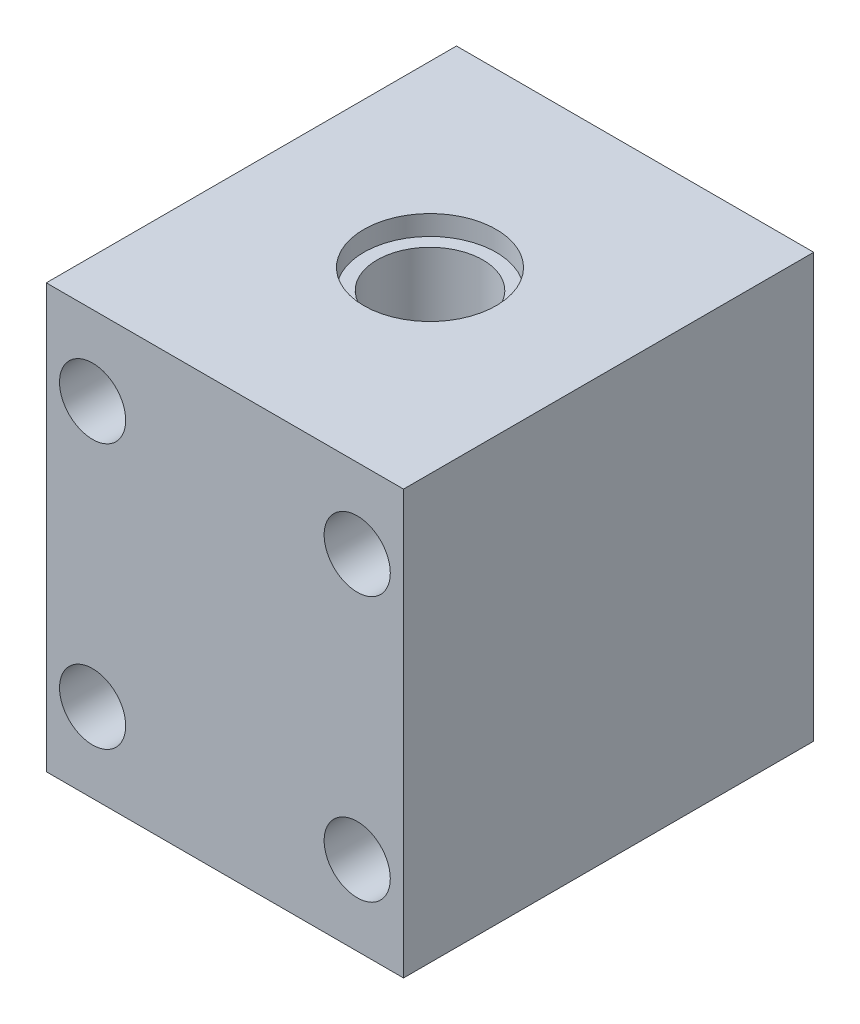
ISO-10303-21;
HEADER;
FILE_DESCRIPTION(('STEP AP214'),'2;1');
FILE_NAME('part.step','',(''),(''),'','','');
FILE_SCHEMA(('AUTOMOTIVE_DESIGN { 1 0 10303 214 1 1 1 1 }'));
ENDSEC;
DATA;
#1=APPLICATION_CONTEXT('core data for automotive mechanical design processes');
#2=APPLICATION_PROTOCOL_DEFINITION('international standard','automotive_design',2000,#1);
#3=PRODUCT_CONTEXT('',#1,'mechanical');
#4=PRODUCT('Part','Part','',(#3));
#5=PRODUCT_RELATED_PRODUCT_CATEGORY('part','',(#4));
#6=PRODUCT_DEFINITION_FORMATION('','',#4);
#7=PRODUCT_DEFINITION_CONTEXT('part definition',#1,'design');
#8=PRODUCT_DEFINITION('design','',#6,#7);
#9=PRODUCT_DEFINITION_SHAPE('','',#8);
#10=(LENGTH_UNIT() NAMED_UNIT(*) SI_UNIT(.MILLI.,.METRE.));
#11=(NAMED_UNIT(*) PLANE_ANGLE_UNIT() SI_UNIT($,.RADIAN.));
#12=(NAMED_UNIT(*) SI_UNIT($,.STERADIAN.) SOLID_ANGLE_UNIT());
#13=UNCERTAINTY_MEASURE_WITH_UNIT(LENGTH_MEASURE(1.E-05),#10,'distance_accuracy_value','');
#14=(GEOMETRIC_REPRESENTATION_CONTEXT(3) GLOBAL_UNCERTAINTY_ASSIGNED_CONTEXT((#13)) GLOBAL_UNIT_ASSIGNED_CONTEXT((#10,
#11,#12)) REPRESENTATION_CONTEXT('',''));
#15=CARTESIAN_POINT('',(0.,0.,0.));
#16=DIRECTION('',(0.,0.,1.));
#17=DIRECTION('',(1.,0.,0.));
#18=AXIS2_PLACEMENT_3D('',#15,#16,#17);
#19=CARTESIAN_POINT('',(10.,10.,31.));
#20=DIRECTION('',(0.,0.,-1.));
#21=DIRECTION('',(-1.,0.,0.));
#22=AXIS2_PLACEMENT_3D('',#19,#20,#21);
#23=CYLINDRICAL_SURFACE('',#22,1.5);
#24=CARTESIAN_POINT('',(10.,10.,0.));
#25=DIRECTION('',(0.,0.,-1.));
#26=DIRECTION('',(-1.,0.,0.));
#27=AXIS2_PLACEMENT_3D('',#24,#25,#26);
#28=CIRCLE('',#27,1.5);
#29=CARTESIAN_POINT('',(8.5,10.,0.));
#30=VERTEX_POINT('',#29);
#31=EDGE_CURVE('E103',#30,#30,#28,.T.);
#32=ORIENTED_EDGE('',*,*,#31,.T.);
#33=EDGE_LOOP('',(#32));
#34=FACE_BOUND('',#33,.T.);
#35=CARTESIAN_POINT('',(10.,10.,16.));
#36=DIRECTION('',(0.,0.,1.));
#37=DIRECTION('',(1.,0.,0.));
#38=AXIS2_PLACEMENT_3D('',#35,#36,#37);
#39=CIRCLE('',#38,1.5);
#40=CARTESIAN_POINT('',(11.5,10.,16.));
#41=VERTEX_POINT('',#40);
#42=EDGE_CURVE('E37',#41,#41,#39,.F.);
#43=ORIENTED_EDGE('',*,*,#42,.F.);
#44=EDGE_LOOP('',(#43));
#45=FACE_BOUND('',#44,.T.);
#46=ADVANCED_FACE('F33',(#34,#45),#23,.F.);
#47=CARTESIAN_POINT('',(-10.,10.,31.));
#48=DIRECTION('',(0.,0.,-1.));
#49=DIRECTION('',(-1.,0.,0.));
#50=AXIS2_PLACEMENT_3D('',#47,#48,#49);
#51=CYLINDRICAL_SURFACE('',#50,1.5);
#52=CARTESIAN_POINT('',(-10.,10.,0.));
#53=DIRECTION('',(0.,0.,-1.));
#54=DIRECTION('',(-1.,0.,0.));
#55=AXIS2_PLACEMENT_3D('',#52,#53,#54);
#56=CIRCLE('',#55,1.5);
#57=CARTESIAN_POINT('',(-11.5,10.,0.));
#58=VERTEX_POINT('',#57);
#59=EDGE_CURVE('E145',#58,#58,#56,.T.);
#60=ORIENTED_EDGE('',*,*,#59,.T.);
#61=EDGE_LOOP('',(#60));
#62=FACE_BOUND('',#61,.T.);
#63=CARTESIAN_POINT('',(-10.,10.,16.));
#64=DIRECTION('',(0.,0.,1.));
#65=DIRECTION('',(1.,0.,0.));
#66=AXIS2_PLACEMENT_3D('',#63,#64,#65);
#67=CIRCLE('',#66,1.5);
#68=CARTESIAN_POINT('',(-8.5,10.,16.));
#69=VERTEX_POINT('',#68);
#70=EDGE_CURVE('E125',#69,#69,#67,.F.);
#71=ORIENTED_EDGE('',*,*,#70,.F.);
#72=EDGE_LOOP('',(#71));
#73=FACE_BOUND('',#72,.T.);
#74=ADVANCED_FACE('F178',(#62,#73),#51,.F.);
#75=CARTESIAN_POINT('',(-10.,-10.,31.));
#76=DIRECTION('',(0.,0.,-1.));
#77=DIRECTION('',(-1.,0.,0.));
#78=AXIS2_PLACEMENT_3D('',#75,#76,#77);
#79=CYLINDRICAL_SURFACE('',#78,1.5);
#80=CARTESIAN_POINT('',(-10.,-10.,0.));
#81=DIRECTION('',(0.,0.,-1.));
#82=DIRECTION('',(-1.,0.,0.));
#83=AXIS2_PLACEMENT_3D('',#80,#81,#82);
#84=CIRCLE('',#83,1.5);
#85=CARTESIAN_POINT('',(-11.5,-10.,0.));
#86=VERTEX_POINT('',#85);
#87=EDGE_CURVE('E148',#86,#86,#84,.T.);
#88=ORIENTED_EDGE('',*,*,#87,.T.);
#89=EDGE_LOOP('',(#88));
#90=FACE_BOUND('',#89,.T.);
#91=CARTESIAN_POINT('',(-10.,-10.,16.));
#92=DIRECTION('',(0.,0.,1.));
#93=DIRECTION('',(1.,0.,0.));
#94=AXIS2_PLACEMENT_3D('',#91,#92,#93);
#95=CIRCLE('',#94,1.5);
#96=CARTESIAN_POINT('',(-8.5,-10.,16.));
#97=VERTEX_POINT('',#96);
#98=EDGE_CURVE('E122',#97,#97,#95,.F.);
#99=ORIENTED_EDGE('',*,*,#98,.F.);
#100=EDGE_LOOP('',(#99));
#101=FACE_BOUND('',#100,.T.);
#102=ADVANCED_FACE('F183',(#90,#101),#79,.F.);
#103=CARTESIAN_POINT('',(10.,-10.,31.));
#104=DIRECTION('',(0.,0.,-1.));
#105=DIRECTION('',(-1.,0.,0.));
#106=AXIS2_PLACEMENT_3D('',#103,#104,#105);
#107=CYLINDRICAL_SURFACE('',#106,1.5);
#108=CARTESIAN_POINT('',(10.,-10.,0.));
#109=DIRECTION('',(0.,0.,-1.));
#110=DIRECTION('',(-1.,0.,0.));
#111=AXIS2_PLACEMENT_3D('',#108,#109,#110);
#112=CIRCLE('',#111,1.5);
#113=CARTESIAN_POINT('',(8.5,-10.,0.));
#114=VERTEX_POINT('',#113);
#115=EDGE_CURVE('E112',#114,#114,#112,.T.);
#116=ORIENTED_EDGE('',*,*,#115,.T.);
#117=EDGE_LOOP('',(#116));
#118=FACE_BOUND('',#117,.T.);
#119=CARTESIAN_POINT('',(10.,-10.,16.));
#120=DIRECTION('',(0.,0.,1.));
#121=DIRECTION('',(1.,0.,0.));
#122=AXIS2_PLACEMENT_3D('',#119,#120,#121);
#123=CIRCLE('',#122,1.5);
#124=CARTESIAN_POINT('',(11.5,-10.,16.));
#125=VERTEX_POINT('',#124);
#126=EDGE_CURVE('E119',#125,#125,#123,.F.);
#127=ORIENTED_EDGE('',*,*,#126,.F.);
#128=EDGE_LOOP('',(#127));
#129=FACE_BOUND('',#128,.T.);
#130=ADVANCED_FACE('F187',(#118,#129),#107,.F.);
#131=CARTESIAN_POINT('',(0.,-16.,15.5));
#132=DIRECTION('',(0.,1.,0.));
#133=DIRECTION('',(0.,0.,1.));
#134=AXIS2_PLACEMENT_3D('',#131,#132,#133);
#135=CYLINDRICAL_SURFACE('',#134,4.);
#136=CARTESIAN_POINT('',(0.,14.5,15.5));
#137=DIRECTION('',(0.,1.,0.));
#138=DIRECTION('',(0.,0.,1.));
#139=AXIS2_PLACEMENT_3D('',#136,#137,#138);
#140=CIRCLE('',#139,4.);
#141=CARTESIAN_POINT('',(0.,14.5,19.5));
#142=VERTEX_POINT('',#141);
#143=EDGE_CURVE('E109',#142,#142,#140,.F.);
#144=ORIENTED_EDGE('',*,*,#143,.F.);
#145=EDGE_LOOP('',(#144));
#146=FACE_BOUND('',#145,.T.);
#147=CARTESIAN_POINT('',(0.,-14.5,15.5));
#148=DIRECTION('',(0.,-1.,0.));
#149=DIRECTION('',(0.,0.,-1.));
#150=AXIS2_PLACEMENT_3D('',#147,#148,#149);
#151=CIRCLE('',#150,4.);
#152=CARTESIAN_POINT('',(0.,-14.5,11.5));
#153=VERTEX_POINT('',#152);
#154=EDGE_CURVE('E114',#153,#153,#151,.F.);
#155=ORIENTED_EDGE('',*,*,#154,.F.);
#156=EDGE_LOOP('',(#155));
#157=FACE_BOUND('',#156,.T.);
#158=ADVANCED_FACE('F190',(#146,#157),#135,.F.);
#159=CARTESIAN_POINT('',(13.5,16.,31.));
#160=DIRECTION('',(-1.,0.,0.));
#161=DIRECTION('',(0.,-1.,0.));
#162=AXIS2_PLACEMENT_3D('',#159,#160,#161);
#163=PLANE('',#162);
#164=DIRECTION('',(0.,1.,0.));
#165=VECTOR('',#164,1.);
#166=CARTESIAN_POINT('',(13.5,16.,0.));
#167=LINE('',#166,#165);
#168=CARTESIAN_POINT('',(13.5,-16.,0.));
#169=VERTEX_POINT('',#168);
#170=CARTESIAN_POINT('',(13.5,16.,0.));
#171=VERTEX_POINT('',#170);
#172=EDGE_CURVE('E100',#169,#171,#167,.T.);
#173=ORIENTED_EDGE('',*,*,#172,.T.);
#174=DIRECTION('',(0.,0.,-1.));
#175=VECTOR('',#174,1.);
#176=CARTESIAN_POINT('',(13.5,16.,31.));
#177=LINE('',#176,#175);
#178=CARTESIAN_POINT('',(13.5,16.,31.));
#179=VERTEX_POINT('',#178);
#180=EDGE_CURVE('E11',#179,#171,#177,.T.);
#181=ORIENTED_EDGE('',*,*,#180,.F.);
#182=DIRECTION('',(0.,1.,0.));
#183=VECTOR('',#182,1.);
#184=CARTESIAN_POINT('',(13.5,16.,31.));
#185=LINE('',#184,#183);
#186=CARTESIAN_POINT('',(13.5,-16.,31.));
#187=VERTEX_POINT('',#186);
#188=EDGE_CURVE('E87',#187,#179,#185,.T.);
#189=ORIENTED_EDGE('',*,*,#188,.F.);
#190=DIRECTION('',(0.,0.,-1.));
#191=VECTOR('',#190,1.);
#192=CARTESIAN_POINT('',(13.5,-16.,31.));
#193=LINE('',#192,#191);
#194=EDGE_CURVE('E96',#187,#169,#193,.T.);
#195=ORIENTED_EDGE('',*,*,#194,.T.);
#196=EDGE_LOOP('',(#173,#181,#189,#195));
#197=FACE_BOUND('',#196,.T.);
#198=ADVANCED_FACE('F35',(#197),#163,.F.);
#199=CARTESIAN_POINT('',(-13.5,16.,31.));
#200=DIRECTION('',(0.,-1.,0.));
#201=DIRECTION('',(0.,0.,-1.));
#202=AXIS2_PLACEMENT_3D('',#199,#200,#201);
#203=PLANE('',#202);
#204=CARTESIAN_POINT('',(0.,16.,15.5));
#205=DIRECTION('',(0.,1.,0.));
#206=DIRECTION('',(0.,0.,1.));
#207=AXIS2_PLACEMENT_3D('',#204,#205,#206);
#208=CIRCLE('',#207,5.);
#209=CARTESIAN_POINT('',(0.,16.,20.5));
#210=VERTEX_POINT('',#209);
#211=EDGE_CURVE('E117',#210,#210,#208,.T.);
#212=ORIENTED_EDGE('',*,*,#211,.F.);
#213=EDGE_LOOP('',(#212));
#214=FACE_BOUND('',#213,.T.);
#215=DIRECTION('',(-1.,0.,0.));
#216=VECTOR('',#215,1.);
#217=CARTESIAN_POINT('',(-13.5,16.,0.));
#218=LINE('',#217,#216);
#219=CARTESIAN_POINT('',(-13.5,16.,0.));
#220=VERTEX_POINT('',#219);
#221=EDGE_CURVE('E91',#171,#220,#218,.T.);
#222=ORIENTED_EDGE('',*,*,#221,.T.);
#223=DIRECTION('',(0.,0.,-1.));
#224=VECTOR('',#223,1.);
#225=CARTESIAN_POINT('',(-13.5,16.,31.));
#226=LINE('',#225,#224);
#227=CARTESIAN_POINT('',(-13.5,16.,31.));
#228=VERTEX_POINT('',#227);
#229=EDGE_CURVE('E43',#228,#220,#226,.T.);
#230=ORIENTED_EDGE('',*,*,#229,.F.);
#231=DIRECTION('',(-1.,0.,0.));
#232=VECTOR('',#231,1.);
#233=CARTESIAN_POINT('',(-13.5,16.,31.));
#234=LINE('',#233,#232);
#235=EDGE_CURVE('E82',#179,#228,#234,.T.);
#236=ORIENTED_EDGE('',*,*,#235,.F.);
#237=ORIENTED_EDGE('',*,*,#180,.T.);
#238=EDGE_LOOP('',(#222,#230,#236,#237));
#239=FACE_BOUND('',#238,.T.);
#240=ADVANCED_FACE('F90',(#214,#239),#203,.F.);
#241=CARTESIAN_POINT('',(-13.5,16.,31.));
#242=DIRECTION('',(1.,0.,0.));
#243=DIRECTION('',(0.,1.,0.));
#244=AXIS2_PLACEMENT_3D('',#241,#242,#243);
#245=PLANE('',#244);
#246=DIRECTION('',(0.,-1.,0.));
#247=VECTOR('',#246,1.);
#248=CARTESIAN_POINT('',(-13.5,16.,0.));
#249=LINE('',#248,#247);
#250=CARTESIAN_POINT('',(-13.5,-16.,0.));
#251=VERTEX_POINT('',#250);
#252=EDGE_CURVE('E69',#220,#251,#249,.T.);
#253=ORIENTED_EDGE('',*,*,#252,.T.);
#254=DIRECTION('',(0.,0.,-1.));
#255=VECTOR('',#254,1.);
#256=CARTESIAN_POINT('',(-13.5,-16.,31.));
#257=LINE('',#256,#255);
#258=CARTESIAN_POINT('',(-13.5,-16.,31.));
#259=VERTEX_POINT('',#258);
#260=EDGE_CURVE('E92',#259,#251,#257,.T.);
#261=ORIENTED_EDGE('',*,*,#260,.F.);
#262=DIRECTION('',(0.,-1.,0.));
#263=VECTOR('',#262,1.);
#264=CARTESIAN_POINT('',(-13.5,16.,31.));
#265=LINE('',#264,#263);
#266=EDGE_CURVE('E85',#228,#259,#265,.T.);
#267=ORIENTED_EDGE('',*,*,#266,.F.);
#268=ORIENTED_EDGE('',*,*,#229,.T.);
#269=EDGE_LOOP('',(#253,#261,#267,#268));
#270=FACE_BOUND('',#269,.T.);
#271=ADVANCED_FACE('F94',(#270),#245,.F.);
#272=CARTESIAN_POINT('',(-13.5,-16.,31.));
#273=DIRECTION('',(0.,1.,0.));
#274=DIRECTION('',(0.,0.,1.));
#275=AXIS2_PLACEMENT_3D('',#272,#273,#274);
#276=PLANE('',#275);
#277=CARTESIAN_POINT('',(0.,-16.,15.5));
#278=DIRECTION('',(0.,-1.,0.));
#279=DIRECTION('',(0.,0.,-1.));
#280=AXIS2_PLACEMENT_3D('',#277,#278,#279);
#281=CIRCLE('',#280,5.);
#282=CARTESIAN_POINT('',(0.,-16.,10.5));
#283=VERTEX_POINT('',#282);
#284=EDGE_CURVE('E130',#283,#283,#281,.T.);
#285=ORIENTED_EDGE('',*,*,#284,.F.);
#286=EDGE_LOOP('',(#285));
#287=FACE_BOUND('',#286,.T.);
#288=DIRECTION('',(1.,0.,0.));
#289=VECTOR('',#288,1.);
#290=CARTESIAN_POINT('',(-13.5,-16.,0.));
#291=LINE('',#290,#289);
#292=EDGE_CURVE('E75',#251,#169,#291,.T.);
#293=ORIENTED_EDGE('',*,*,#292,.T.);
#294=ORIENTED_EDGE('',*,*,#194,.F.);
#295=DIRECTION('',(1.,0.,0.));
#296=VECTOR('',#295,1.);
#297=CARTESIAN_POINT('',(-13.5,-16.,31.));
#298=LINE('',#297,#296);
#299=EDGE_CURVE('E52',#259,#187,#298,.T.);
#300=ORIENTED_EDGE('',*,*,#299,.F.);
#301=ORIENTED_EDGE('',*,*,#260,.T.);
#302=EDGE_LOOP('',(#293,#294,#300,#301));
#303=FACE_BOUND('',#302,.T.);
#304=ADVANCED_FACE('F166',(#287,#303),#276,.F.);
#305=CARTESIAN_POINT('',(0.,0.,31.));
#306=DIRECTION('',(0.,0.,1.));
#307=DIRECTION('',(1.,0.,0.));
#308=AXIS2_PLACEMENT_3D('',#305,#306,#307);
#309=PLANE('',#308);
#310=CARTESIAN_POINT('',(-10.,-10.,31.));
#311=DIRECTION('',(0.,0.,1.));
#312=DIRECTION('',(1.,0.,0.));
#313=AXIS2_PLACEMENT_3D('',#310,#311,#312);
#314=CIRCLE('',#313,2.5);
#315=CARTESIAN_POINT('',(-7.5,-10.,31.));
#316=VERTEX_POINT('',#315);
#317=EDGE_CURVE('E265',#316,#316,#314,.T.);
#318=ORIENTED_EDGE('',*,*,#317,.F.);
#319=EDGE_LOOP('',(#318));
#320=FACE_BOUND('',#319,.T.);
#321=CARTESIAN_POINT('',(10.,-10.,31.));
#322=DIRECTION('',(0.,0.,1.));
#323=DIRECTION('',(1.,0.,0.));
#324=AXIS2_PLACEMENT_3D('',#321,#322,#323);
#325=CIRCLE('',#324,2.5);
#326=CARTESIAN_POINT('',(12.5,-10.,31.));
#327=VERTEX_POINT('',#326);
#328=EDGE_CURVE('E259',#327,#327,#325,.T.);
#329=ORIENTED_EDGE('',*,*,#328,.F.);
#330=EDGE_LOOP('',(#329));
#331=FACE_BOUND('',#330,.T.);
#332=CARTESIAN_POINT('',(10.,10.,31.));
#333=DIRECTION('',(0.,0.,1.));
#334=DIRECTION('',(1.,0.,0.));
#335=AXIS2_PLACEMENT_3D('',#332,#333,#334);
#336=CIRCLE('',#335,2.5);
#337=CARTESIAN_POINT('',(12.5,10.,31.));
#338=VERTEX_POINT('',#337);
#339=EDGE_CURVE('E250',#338,#338,#336,.T.);
#340=ORIENTED_EDGE('',*,*,#339,.F.);
#341=EDGE_LOOP('',(#340));
#342=FACE_BOUND('',#341,.T.);
#343=CARTESIAN_POINT('',(-10.,10.,31.));
#344=DIRECTION('',(0.,0.,1.));
#345=DIRECTION('',(1.,0.,0.));
#346=AXIS2_PLACEMENT_3D('',#343,#344,#345);
#347=CIRCLE('',#346,2.5);
#348=CARTESIAN_POINT('',(-7.5,10.,31.));
#349=VERTEX_POINT('',#348);
#350=EDGE_CURVE('E249',#349,#349,#347,.T.);
#351=ORIENTED_EDGE('',*,*,#350,.F.);
#352=EDGE_LOOP('',(#351));
#353=FACE_BOUND('',#352,.T.);
#354=ORIENTED_EDGE('',*,*,#188,.T.);
#355=ORIENTED_EDGE('',*,*,#235,.T.);
#356=ORIENTED_EDGE('',*,*,#266,.T.);
#357=ORIENTED_EDGE('',*,*,#299,.T.);
#358=EDGE_LOOP('',(#354,#355,#356,#357));
#359=FACE_BOUND('',#358,.T.);
#360=ADVANCED_FACE('F83',(#320,#331,#342,#353,#359),#309,.T.);
#361=CARTESIAN_POINT('',(0.,0.,0.));
#362=DIRECTION('',(0.,0.,1.));
#363=DIRECTION('',(1.,0.,0.));
#364=AXIS2_PLACEMENT_3D('',#361,#362,#363);
#365=PLANE('',#364);
#366=ORIENTED_EDGE('',*,*,#115,.F.);
#367=EDGE_LOOP('',(#366));
#368=FACE_BOUND('',#367,.T.);
#369=ORIENTED_EDGE('',*,*,#87,.F.);
#370=EDGE_LOOP('',(#369));
#371=FACE_BOUND('',#370,.T.);
#372=ORIENTED_EDGE('',*,*,#59,.F.);
#373=EDGE_LOOP('',(#372));
#374=FACE_BOUND('',#373,.T.);
#375=ORIENTED_EDGE('',*,*,#31,.F.);
#376=EDGE_LOOP('',(#375));
#377=FACE_BOUND('',#376,.T.);
#378=ORIENTED_EDGE('',*,*,#172,.F.);
#379=ORIENTED_EDGE('',*,*,#292,.F.);
#380=ORIENTED_EDGE('',*,*,#252,.F.);
#381=ORIENTED_EDGE('',*,*,#221,.F.);
#382=EDGE_LOOP('',(#378,#379,#380,#381));
#383=FACE_BOUND('',#382,.T.);
#384=ADVANCED_FACE('F158',(#368,#371,#374,#377,#383),#365,.F.);
#385=CARTESIAN_POINT('',(0.,14.5,15.5));
#386=DIRECTION('',(0.,1.,0.));
#387=DIRECTION('',(0.,0.,1.));
#388=AXIS2_PLACEMENT_3D('',#385,#386,#387);
#389=PLANE('',#388);
#390=CARTESIAN_POINT('',(0.,14.5,15.5));
#391=DIRECTION('',(0.,1.,0.));
#392=DIRECTION('',(0.,0.,1.));
#393=AXIS2_PLACEMENT_3D('',#390,#391,#392);
#394=CIRCLE('',#393,5.);
#395=CARTESIAN_POINT('',(0.,14.5,20.5));
#396=VERTEX_POINT('',#395);
#397=EDGE_CURVE('E113',#396,#396,#394,.T.);
#398=ORIENTED_EDGE('',*,*,#397,.T.);
#399=EDGE_LOOP('',(#398));
#400=FACE_BOUND('',#399,.T.);
#401=ORIENTED_EDGE('',*,*,#143,.T.);
#402=EDGE_LOOP('',(#401));
#403=FACE_BOUND('',#402,.T.);
#404=ADVANCED_FACE('F161',(#400,#403),#389,.T.);
#405=CARTESIAN_POINT('',(0.,14.5,15.5));
#406=DIRECTION('',(0.,1.,0.));
#407=DIRECTION('',(0.,0.,1.));
#408=AXIS2_PLACEMENT_3D('',#405,#406,#407);
#409=CYLINDRICAL_SURFACE('',#408,5.);
#410=ORIENTED_EDGE('',*,*,#397,.F.);
#411=EDGE_LOOP('',(#410));
#412=FACE_BOUND('',#411,.T.);
#413=ORIENTED_EDGE('',*,*,#211,.T.);
#414=EDGE_LOOP('',(#413));
#415=FACE_BOUND('',#414,.T.);
#416=ADVANCED_FACE('F198',(#412,#415),#409,.F.);
#417=CARTESIAN_POINT('',(0.,-14.5,15.5));
#418=DIRECTION('',(0.,-1.,0.));
#419=DIRECTION('',(0.,0.,-1.));
#420=AXIS2_PLACEMENT_3D('',#417,#418,#419);
#421=PLANE('',#420);
#422=CARTESIAN_POINT('',(0.,-14.5,15.5));
#423=DIRECTION('',(0.,-1.,0.));
#424=DIRECTION('',(0.,0.,-1.));
#425=AXIS2_PLACEMENT_3D('',#422,#423,#424);
#426=CIRCLE('',#425,5.);
#427=CARTESIAN_POINT('',(0.,-14.5,10.5));
#428=VERTEX_POINT('',#427);
#429=EDGE_CURVE('E118',#428,#428,#426,.T.);
#430=ORIENTED_EDGE('',*,*,#429,.T.);
#431=EDGE_LOOP('',(#430));
#432=FACE_BOUND('',#431,.T.);
#433=ORIENTED_EDGE('',*,*,#154,.T.);
#434=EDGE_LOOP('',(#433));
#435=FACE_BOUND('',#434,.T.);
#436=ADVANCED_FACE('F201',(#432,#435),#421,.T.);
#437=CARTESIAN_POINT('',(0.,-14.5,15.5));
#438=DIRECTION('',(0.,-1.,0.));
#439=DIRECTION('',(0.,0.,-1.));
#440=AXIS2_PLACEMENT_3D('',#437,#438,#439);
#441=CYLINDRICAL_SURFACE('',#440,5.);
#442=ORIENTED_EDGE('',*,*,#429,.F.);
#443=EDGE_LOOP('',(#442));
#444=FACE_BOUND('',#443,.T.);
#445=ORIENTED_EDGE('',*,*,#284,.T.);
#446=EDGE_LOOP('',(#445));
#447=FACE_BOUND('',#446,.T.);
#448=ADVANCED_FACE('F206',(#444,#447),#441,.F.);
#449=CARTESIAN_POINT('',(10.,-10.,16.));
#450=DIRECTION('',(0.,0.,1.));
#451=DIRECTION('',(1.,0.,0.));
#452=AXIS2_PLACEMENT_3D('',#449,#450,#451);
#453=PLANE('',#452);
#454=CARTESIAN_POINT('',(10.,-10.,16.));
#455=DIRECTION('',(0.,0.,1.));
#456=DIRECTION('',(1.,0.,0.));
#457=AXIS2_PLACEMENT_3D('',#454,#455,#456);
#458=CIRCLE('',#457,2.5);
#459=CARTESIAN_POINT('',(12.5,-10.,16.));
#460=VERTEX_POINT('',#459);
#461=EDGE_CURVE('E254',#460,#460,#458,.T.);
#462=ORIENTED_EDGE('',*,*,#461,.T.);
#463=EDGE_LOOP('',(#462));
#464=FACE_BOUND('',#463,.T.);
#465=ORIENTED_EDGE('',*,*,#126,.T.);
#466=EDGE_LOOP('',(#465));
#467=FACE_BOUND('',#466,.T.);
#468=ADVANCED_FACE('F209',(#464,#467),#453,.T.);
#469=CARTESIAN_POINT('',(10.,-10.,16.));
#470=DIRECTION('',(0.,0.,1.));
#471=DIRECTION('',(1.,0.,0.));
#472=AXIS2_PLACEMENT_3D('',#469,#470,#471);
#473=CYLINDRICAL_SURFACE('',#472,2.5);
#474=ORIENTED_EDGE('',*,*,#461,.F.);
#475=EDGE_LOOP('',(#474));
#476=FACE_BOUND('',#475,.T.);
#477=ORIENTED_EDGE('',*,*,#328,.T.);
#478=EDGE_LOOP('',(#477));
#479=FACE_BOUND('',#478,.T.);
#480=ADVANCED_FACE('F230',(#476,#479),#473,.F.);
#481=CARTESIAN_POINT('',(-10.,-10.,16.));
#482=DIRECTION('',(0.,0.,1.));
#483=DIRECTION('',(1.,0.,0.));
#484=AXIS2_PLACEMENT_3D('',#481,#482,#483);
#485=PLANE('',#484);
#486=CARTESIAN_POINT('',(-10.,-10.,16.));
#487=DIRECTION('',(0.,0.,1.));
#488=DIRECTION('',(1.,0.,0.));
#489=AXIS2_PLACEMENT_3D('',#486,#487,#488);
#490=CIRCLE('',#489,2.5);
#491=CARTESIAN_POINT('',(-7.5,-10.,16.));
#492=VERTEX_POINT('',#491);
#493=EDGE_CURVE('E262',#492,#492,#490,.T.);
#494=ORIENTED_EDGE('',*,*,#493,.T.);
#495=EDGE_LOOP('',(#494));
#496=FACE_BOUND('',#495,.T.);
#497=ORIENTED_EDGE('',*,*,#98,.T.);
#498=EDGE_LOOP('',(#497));
#499=FACE_BOUND('',#498,.T.);
#500=ADVANCED_FACE('F226',(#496,#499),#485,.T.);
#501=CARTESIAN_POINT('',(-10.,-10.,16.));
#502=DIRECTION('',(0.,0.,1.));
#503=DIRECTION('',(1.,0.,0.));
#504=AXIS2_PLACEMENT_3D('',#501,#502,#503);
#505=CYLINDRICAL_SURFACE('',#504,2.5);
#506=ORIENTED_EDGE('',*,*,#493,.F.);
#507=EDGE_LOOP('',(#506));
#508=FACE_BOUND('',#507,.T.);
#509=ORIENTED_EDGE('',*,*,#317,.T.);
#510=EDGE_LOOP('',(#509));
#511=FACE_BOUND('',#510,.T.);
#512=ADVANCED_FACE('F222',(#508,#511),#505,.F.);
#513=CARTESIAN_POINT('',(-10.,10.,16.));
#514=DIRECTION('',(0.,0.,1.));
#515=DIRECTION('',(1.,0.,0.));
#516=AXIS2_PLACEMENT_3D('',#513,#514,#515);
#517=PLANE('',#516);
#518=CARTESIAN_POINT('',(-10.,10.,16.));
#519=DIRECTION('',(0.,0.,1.));
#520=DIRECTION('',(1.,0.,0.));
#521=AXIS2_PLACEMENT_3D('',#518,#519,#520);
#522=CIRCLE('',#521,2.5);
#523=CARTESIAN_POINT('',(-7.5,10.,16.));
#524=VERTEX_POINT('',#523);
#525=EDGE_CURVE('E123',#524,#524,#522,.T.);
#526=ORIENTED_EDGE('',*,*,#525,.T.);
#527=EDGE_LOOP('',(#526));
#528=FACE_BOUND('',#527,.T.);
#529=ORIENTED_EDGE('',*,*,#70,.T.);
#530=EDGE_LOOP('',(#529));
#531=FACE_BOUND('',#530,.T.);
#532=ADVANCED_FACE('F218',(#528,#531),#517,.T.);
#533=CARTESIAN_POINT('',(-10.,10.,16.));
#534=DIRECTION('',(0.,0.,1.));
#535=DIRECTION('',(1.,0.,0.));
#536=AXIS2_PLACEMENT_3D('',#533,#534,#535);
#537=CYLINDRICAL_SURFACE('',#536,2.5);
#538=ORIENTED_EDGE('',*,*,#525,.F.);
#539=EDGE_LOOP('',(#538));
#540=FACE_BOUND('',#539,.T.);
#541=ORIENTED_EDGE('',*,*,#350,.T.);
#542=EDGE_LOOP('',(#541));
#543=FACE_BOUND('',#542,.T.);
#544=ADVANCED_FACE('F214',(#540,#543),#537,.F.);
#545=CARTESIAN_POINT('',(10.,10.,16.));
#546=DIRECTION('',(0.,0.,1.));
#547=DIRECTION('',(1.,0.,0.));
#548=AXIS2_PLACEMENT_3D('',#545,#546,#547);
#549=PLANE('',#548);
#550=CARTESIAN_POINT('',(10.,10.,16.));
#551=DIRECTION('',(0.,0.,1.));
#552=DIRECTION('',(1.,0.,0.));
#553=AXIS2_PLACEMENT_3D('',#550,#551,#552);
#554=CIRCLE('',#553,2.5);
#555=CARTESIAN_POINT('',(12.5,10.,16.));
#556=VERTEX_POINT('',#555);
#557=EDGE_CURVE('E248',#556,#556,#554,.T.);
#558=ORIENTED_EDGE('',*,*,#557,.T.);
#559=EDGE_LOOP('',(#558));
#560=FACE_BOUND('',#559,.T.);
#561=ORIENTED_EDGE('',*,*,#42,.T.);
#562=EDGE_LOOP('',(#561));
#563=FACE_BOUND('',#562,.T.);
#564=ADVANCED_FACE('F217',(#560,#563),#549,.T.);
#565=CARTESIAN_POINT('',(10.,10.,16.));
#566=DIRECTION('',(0.,0.,1.));
#567=DIRECTION('',(1.,0.,0.));
#568=AXIS2_PLACEMENT_3D('',#565,#566,#567);
#569=CYLINDRICAL_SURFACE('',#568,2.5);
#570=ORIENTED_EDGE('',*,*,#557,.F.);
#571=EDGE_LOOP('',(#570));
#572=FACE_BOUND('',#571,.T.);
#573=ORIENTED_EDGE('',*,*,#339,.T.);
#574=EDGE_LOOP('',(#573));
#575=FACE_BOUND('',#574,.T.);
#576=ADVANCED_FACE('F238',(#572,#575),#569,.F.);
#577=CLOSED_SHELL('',(#46,#74,#102,#130,#158,#198,#240,#271,#304,#360,#384,#404,#416,#436,#448,
#468,#480,#500,#512,#532,#544,#564,#576));
#578=MANIFOLD_SOLID_BREP('B2',#577);
#579=ADVANCED_BREP_SHAPE_REPRESENTATION('',(#18,#578),#14);
#580=SHAPE_DEFINITION_REPRESENTATION(#9,#579);
ENDSEC;
END-ISO-10303-21;
